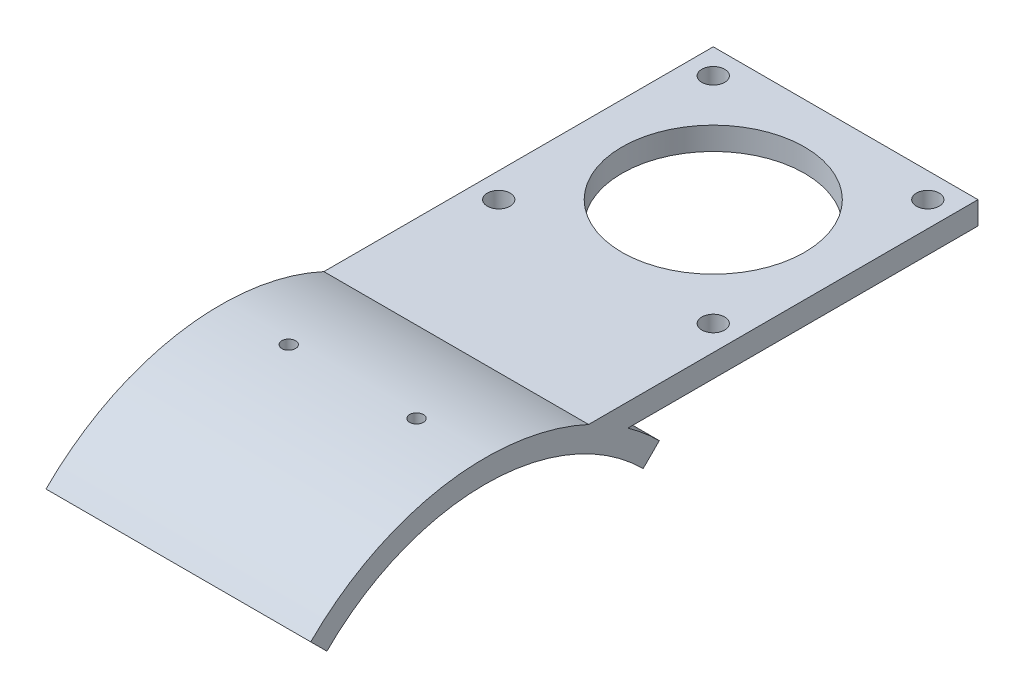
ISO-10303-21;
HEADER;
FILE_DESCRIPTION(('STEP AP214'),'2;1');
FILE_NAME('part.step','',(''),(''),'','','');
FILE_SCHEMA(('AUTOMOTIVE_DESIGN { 1 0 10303 214 1 1 1 1 }'));
ENDSEC;
DATA;
#1=APPLICATION_CONTEXT('core data for automotive mechanical design processes');
#2=APPLICATION_PROTOCOL_DEFINITION('international standard','automotive_design',2000,#1);
#3=PRODUCT_CONTEXT('',#1,'mechanical');
#4=PRODUCT('Part','Part','',(#3));
#5=PRODUCT_RELATED_PRODUCT_CATEGORY('part','',(#4));
#6=PRODUCT_DEFINITION_FORMATION('','',#4);
#7=PRODUCT_DEFINITION_CONTEXT('part definition',#1,'design');
#8=PRODUCT_DEFINITION('design','',#6,#7);
#9=PRODUCT_DEFINITION_SHAPE('','',#8);
#10=(LENGTH_UNIT() NAMED_UNIT(*) SI_UNIT(.MILLI.,.METRE.));
#11=(NAMED_UNIT(*) PLANE_ANGLE_UNIT() SI_UNIT($,.RADIAN.));
#12=(NAMED_UNIT(*) SI_UNIT($,.STERADIAN.) SOLID_ANGLE_UNIT());
#13=UNCERTAINTY_MEASURE_WITH_UNIT(LENGTH_MEASURE(1.E-05),#10,'distance_accuracy_value','');
#14=(GEOMETRIC_REPRESENTATION_CONTEXT(3) GLOBAL_UNCERTAINTY_ASSIGNED_CONTEXT((#13)) GLOBAL_UNIT_ASSIGNED_CONTEXT((#10,
#11,#12)) REPRESENTATION_CONTEXT('',''));
#15=CARTESIAN_POINT('',(0.,0.,0.));
#16=DIRECTION('',(0.,0.,1.));
#17=DIRECTION('',(1.,0.,0.));
#18=AXIS2_PLACEMENT_3D('',#15,#16,#17);
#19=CARTESIAN_POINT('',(58.,-49.,0.));
#20=DIRECTION('',(-1.,0.,0.));
#21=DIRECTION('',(0.,0.,1.));
#22=AXIS2_PLACEMENT_3D('',#19,#20,#21);
#23=CYLINDRICAL_SURFACE('',#22,54.);
#24=CARTESIAN_POINT('',(15.,4.97916264633973,-1.5));
#25=CARTESIAN_POINT('',(14.9157617818594,4.97916292759127,-1.4999962697119));
#26=CARTESIAN_POINT('',(14.8314628967319,4.97936195378429,-1.49288010498638));
#27=CARTESIAN_POINT('',(14.6651879580694,4.98013675004673,-1.46459173198199));
#28=CARTESIAN_POINT('',(14.5832148045829,4.98071297061975,-1.44340271529465));
#29=CARTESIAN_POINT('',(14.4240242210122,4.98217683116193,-1.38757338006493));
#30=CARTESIAN_POINT('',(14.3468044934685,4.98306431927556,-1.35293961982023));
#31=CARTESIAN_POINT('',(14.1992967478397,4.98505051841892,-1.27121327193724));
#32=CARTESIAN_POINT('',(14.129007038924,4.98614917773183,-1.22412373371793));
#33=CARTESIAN_POINT('',(13.9973039831279,4.98843445369547,-1.11879957157692));
#34=CARTESIAN_POINT('',(13.9358937131143,4.98962110062087,-1.06056110054096));
#35=CARTESIAN_POINT('',(13.8237185609425,4.99194833217108,-0.934598752068324));
#36=CARTESIAN_POINT('',(13.7729541018723,4.99308891496375,-0.866874497823953));
#37=CARTESIAN_POINT('',(13.6835075489127,4.99519557614055,-0.723852589454354));
#38=CARTESIAN_POINT('',(13.6448271840814,4.99616162954374,-0.648553853566808));
#39=CARTESIAN_POINT('',(13.5806581185904,4.99781010873021,-0.492528174295414));
#40=CARTESIAN_POINT('',(13.555169368811,4.99849253556959,-0.411801251124983));
#41=CARTESIAN_POINT('',(13.5181133603416,4.99949667712531,-0.247232903532651));
#42=CARTESIAN_POINT('',(13.506542488956,4.99981848544674,-0.163392293165112));
#43=CARTESIAN_POINT('',(13.4976395672055,5.00006542723468,0.00504189886415992));
#44=CARTESIAN_POINT('',(13.5003074644804,4.99999056215987,0.0896354777558623));
#45=CARTESIAN_POINT('',(13.5198032830859,4.99945267694046,0.257149821465281));
#46=CARTESIAN_POINT('',(13.53662729998,4.99898976382453,0.340071041084011));
#47=CARTESIAN_POINT('',(13.5839517483097,4.99772807990447,0.501911727654212));
#48=CARTESIAN_POINT('',(13.6144522075773,4.99692930841686,0.580831186461557));
#49=CARTESIAN_POINT('',(13.6882682198389,4.99508575332067,0.732440646581693));
#50=CARTESIAN_POINT('',(13.7315855625671,4.99404093535863,0.805129776069335));
#51=CARTESIAN_POINT('',(13.8298043792621,4.99182304238371,0.942205619379503));
#52=CARTESIAN_POINT('',(13.8847058752588,4.99064996712692,1.00659231741272));
#53=CARTESIAN_POINT('',(14.0045566502031,4.98830730090679,1.12525836084267));
#54=CARTESIAN_POINT('',(14.0695093180798,4.98713771125475,1.17953428356121));
#55=CARTESIAN_POINT('',(14.2076067019493,4.98493427597559,1.276411723899));
#56=CARTESIAN_POINT('',(14.2807514192431,4.98390043037003,1.31901323966435));
#57=CARTESIAN_POINT('',(14.4331584869265,4.98208508233468,1.39133217569352));
#58=CARTESIAN_POINT('',(14.5124208892622,4.98130358204788,1.42104948654181));
#59=CARTESIAN_POINT('',(14.6748124717556,4.98008113313439,1.46675424476639));
#60=CARTESIAN_POINT('',(14.7579416428515,4.97964018370967,1.48274172431697));
#61=CARTESIAN_POINT('',(14.9256772396059,4.97914869894478,1.50052879463532));
#62=CARTESIAN_POINT('',(15.0102831621887,4.97909803315392,1.50233312606613));
#63=CARTESIAN_POINT('',(15.1785967353642,4.97939248809537,1.49171503391734));
#64=CARTESIAN_POINT('',(15.2623043868432,4.97973760843708,1.47929262437793));
#65=CARTESIAN_POINT('',(15.4264320235609,4.98078461077078,1.44057760512654));
#66=CARTESIAN_POINT('',(15.5068525170401,4.98148643738383,1.41428714841584));
#67=CARTESIAN_POINT('',(15.6621385752962,4.98316768693185,1.34858451455344));
#68=CARTESIAN_POINT('',(15.7370041305899,4.98414711034071,1.30917231500142));
#69=CARTESIAN_POINT('',(15.8790769764869,4.98627346001791,1.21833275044408));
#70=CARTESIAN_POINT('',(15.9462822247022,4.98742043077255,1.16690219220532));
#71=CARTESIAN_POINT('',(16.0711062260081,4.98975241685706,1.05349052957631));
#72=CARTESIAN_POINT('',(16.1287249575708,4.99093743227236,0.991509401493973));
#73=CARTESIAN_POINT('',(16.2327561375288,4.99321229794382,0.858735727671517));
#74=CARTESIAN_POINT('',(16.2791655285893,4.99430212218508,0.787940785934883));
#75=CARTESIAN_POINT('',(16.35943971584,4.99626338072533,0.639561355594224));
#76=CARTESIAN_POINT('',(16.3933045381539,4.99713481547911,0.561976881129636));
#77=CARTESIAN_POINT('',(16.4475229331903,4.9985609354325,0.402232265380035));
#78=CARTESIAN_POINT('',(16.4678784891357,4.9991156671239,0.320072797645568));
#79=CARTESIAN_POINT('',(16.4945070387233,4.99984603166259,0.153500833727171));
#80=CARTESIAN_POINT('',(16.5007800393144,5.00002166469693,0.0690883386550062));
#81=CARTESIAN_POINT('',(16.4990651738358,4.99997403577854,-0.0995628843776949));
#82=CARTESIAN_POINT('',(16.4910821291345,4.99975090868573,-0.183801661443545));
#83=CARTESIAN_POINT('',(16.461091688717,4.99893116776891,-0.349742853279947));
#84=CARTESIAN_POINT('',(16.4390842651638,4.99833455320357,-0.431445263015735));
#85=CARTESIAN_POINT('',(16.3816703628346,4.99683504558709,-0.589996526137956));
#86=CARTESIAN_POINT('',(16.3462636546536,4.9959321472922,-0.666845296400451));
#87=CARTESIAN_POINT('',(16.2630581343751,4.99392182150439,-0.813505946148473));
#88=CARTESIAN_POINT('',(16.2152597759056,4.99281440149893,-0.883318083098023));
#89=CARTESIAN_POINT('',(16.1086144311051,4.99051945763676,-1.0139453858344));
#90=CARTESIAN_POINT('',(16.049764887359,4.98933191527935,-1.07475846326365));
#91=CARTESIAN_POINT('',(15.9226744260106,4.98701047901731,-1.18565812553995));
#92=CARTESIAN_POINT('',(15.8544311853236,4.98587659847689,-1.2357420491842));
#93=CARTESIAN_POINT('',(15.7104659219413,4.98378998875727,-1.32376904679058));
#94=CARTESIAN_POINT('',(15.6347392597637,4.98283737304061,-1.36170452652514));
#95=CARTESIAN_POINT('',(15.4780477325282,4.98122282709044,-1.42427916659829));
#96=CARTESIAN_POINT('',(15.3970892486569,4.98056055013531,-1.44893419450462));
#97=CARTESIAN_POINT('',(15.2630155921275,4.97977853060093,-1.47770893356339));
#98=CARTESIAN_POINT('',(15.2107708019174,4.97954857619368,-1.48605757762348));
#99=CARTESIAN_POINT('',(15.1056919699062,4.97924054584215,-1.49720428048581));
#100=CARTESIAN_POINT('',(15.0528579282537,4.97916246985958,-1.50000234068698));
#101=CARTESIAN_POINT('',(15.,4.97916264633973,-1.5));
#102=B_SPLINE_CURVE_WITH_KNOTS('',3,(#24,#25,#26,#27,#28,#29,#30,#31,#32,#33,#34,#35,#36,#37,
#38,#39,#40,#41,#42,#43,#44,#45,#46,#47,#48,#49,#50,#51,#52,#53,#54,#55,#56,#57,#58,#59,#60,#61,
#62,#63,#64,#65,#66,#67,#68,#69,#70,#71,#72,#73,#74,#75,#76,#77,#78,#79,#80,#81,#82,#83,#84,#85,
#86,#87,#88,#89,#90,#91,#92,#93,#94,#95,#96,#97,#98,#99,#100,#101),.UNSPECIFIED.,.T.,.F.,(4,2,2,
2,2,2,2,2,2,2,2,2,2,2,2,2,2,2,2,2,2,2,2,2,2,2,2,2,2,2,2,2,2,2,2,2,2,2,4),(0.,0.252521717052329,
0.505345586051272,0.758046283128763,1.01068517128276,1.26341139410214,1.51614765891835,
1.76892007007343,2.02169154000989,2.27439738330734,2.52710229733078,2.77973753498833,
3.0323732867723,3.28504433297249,3.53771585968755,3.79047276541315,4.04322971127656,
4.29598880356596,4.54874730354162,4.801421316361,5.05409507981991,5.30672962745492,
5.55936460636857,5.81206678593596,6.06476953297256,6.31754112675861,6.57031219415158,
6.82304614536903,7.07577997187629,7.32842834045143,7.58107721050897,7.83373040628491,
8.08637435435147,8.33907684034282,8.59184193294208,8.8447647268471,9.09738465288879,
9.25583741294422,9.41429013306435),.UNSPECIFIED.);
#103=CARTESIAN_POINT('',(15.,4.97916264633973,-1.5));
#104=VERTEX_POINT('',#103);
#105=EDGE_CURVE('E169',#104,#104,#102,.T.);
#106=ORIENTED_EDGE('',*,*,#105,.F.);
#107=EDGE_LOOP('',(#106));
#108=FACE_BOUND('',#107,.T.);
#109=CARTESIAN_POINT('',(0.,-49.,0.));
#110=DIRECTION('',(1.,0.,0.));
#111=DIRECTION('',(0.,0.,-1.));
#112=AXIS2_PLACEMENT_3D('',#109,#110,#111);
#113=CIRCLE('',#112,54.);
#114=CARTESIAN_POINT('',(0.,0.,-22.6936114358204));
#115=VERTEX_POINT('',#114);
#116=CARTESIAN_POINT('',(0.,-10.8162338159265,38.1837661840737));
#117=VERTEX_POINT('',#116);
#118=EDGE_CURVE('E85',#115,#117,#113,.T.);
#119=ORIENTED_EDGE('',*,*,#118,.T.);
#120=DIRECTION('',(-1.,0.,0.));
#121=VECTOR('',#120,1.);
#122=CARTESIAN_POINT('',(58.,-10.8162338159265,38.1837661840737));
#123=LINE('',#122,#121);
#124=CARTESIAN_POINT('',(58.,-10.8162338159265,38.1837661840737));
#125=VERTEX_POINT('',#124);
#126=EDGE_CURVE('E130',#125,#117,#123,.T.);
#127=ORIENTED_EDGE('',*,*,#126,.F.);
#128=CARTESIAN_POINT('',(58.,-49.,0.));
#129=DIRECTION('',(1.,0.,0.));
#130=DIRECTION('',(0.,0.,1.));
#131=AXIS2_PLACEMENT_3D('',#128,#129,#130);
#132=CIRCLE('',#131,54.);
#133=CARTESIAN_POINT('',(58.,0.,-22.6936114358204));
#134=VERTEX_POINT('',#133);
#135=EDGE_CURVE('E117',#134,#125,#132,.T.);
#136=ORIENTED_EDGE('',*,*,#135,.F.);
#137=DIRECTION('',(-1.,0.,0.));
#138=VECTOR('',#137,1.);
#139=CARTESIAN_POINT('',(58.,0.,-22.6936114358204));
#140=LINE('',#139,#138);
#141=EDGE_CURVE('E125',#134,#115,#140,.T.);
#142=ORIENTED_EDGE('',*,*,#141,.T.);
#143=EDGE_LOOP('',(#119,#127,#136,#142));
#144=FACE_BOUND('',#143,.T.);
#145=CARTESIAN_POINT('',(43.,4.97916264633973,-1.5));
#146=CARTESIAN_POINT('',(42.9157617818595,4.97916292759127,-1.49999626971189));
#147=CARTESIAN_POINT('',(42.8314628967319,4.97936195378429,-1.49288010498638));
#148=CARTESIAN_POINT('',(42.6651879580694,4.98013675004673,-1.46459173198199));
#149=CARTESIAN_POINT('',(42.5832148045829,4.98071297061975,-1.44340271529465));
#150=CARTESIAN_POINT('',(42.4240242210122,4.98217683116193,-1.38757338006493));
#151=CARTESIAN_POINT('',(42.3468044934685,4.98306431927556,-1.35293961982023));
#152=CARTESIAN_POINT('',(42.1992967478397,4.98505051841892,-1.27121327193724));
#153=CARTESIAN_POINT('',(42.129007038924,4.98614917773183,-1.22412373371793));
#154=CARTESIAN_POINT('',(41.9973039831279,4.98843445369547,-1.11879957157692));
#155=CARTESIAN_POINT('',(41.9358937131143,4.98962110062087,-1.06056110054097));
#156=CARTESIAN_POINT('',(41.8237185609425,4.99194833217108,-0.934598752068325));
#157=CARTESIAN_POINT('',(41.7729541018723,4.99308891496375,-0.866874497823953));
#158=CARTESIAN_POINT('',(41.6835075489127,4.99519557614055,-0.723852589454355));
#159=CARTESIAN_POINT('',(41.6448271840814,4.99616162954374,-0.64855385356681));
#160=CARTESIAN_POINT('',(41.5806581185904,4.99781010873021,-0.492528174295419));
#161=CARTESIAN_POINT('',(41.555169368811,4.99849253556959,-0.411801251124988));
#162=CARTESIAN_POINT('',(41.5181133603416,4.99949667712531,-0.247232903532657));
#163=CARTESIAN_POINT('',(41.506542488956,4.99981848544674,-0.16339229316512));
#164=CARTESIAN_POINT('',(41.4976395672055,5.00006542723468,0.00504189886415126));
#165=CARTESIAN_POINT('',(41.5003074644804,4.99999056215987,0.0896354777558533));
#166=CARTESIAN_POINT('',(41.5198032830859,4.99945267694046,0.257149821465272));
#167=CARTESIAN_POINT('',(41.5366272999801,4.99898976382453,0.340071041084001));
#168=CARTESIAN_POINT('',(41.5839517483097,4.99772807990447,0.501911727654204));
#169=CARTESIAN_POINT('',(41.6144522075774,4.99692930841686,0.58083118646155));
#170=CARTESIAN_POINT('',(41.6882682198389,4.99508575332067,0.732440646581686));
#171=CARTESIAN_POINT('',(41.7315855625671,4.99404093535863,0.80512977606933));
#172=CARTESIAN_POINT('',(41.8298043792621,4.99182304238371,0.942205619379497));
#173=CARTESIAN_POINT('',(41.8847058752588,4.99064996712692,1.00659231741271));
#174=CARTESIAN_POINT('',(42.0045566502031,4.98830730090679,1.12525836084266));
#175=CARTESIAN_POINT('',(42.0695093180798,4.98713771125475,1.17953428356121));
#176=CARTESIAN_POINT('',(42.2076067019493,4.98493427597559,1.27641172389899));
#177=CARTESIAN_POINT('',(42.2807514192431,4.98390043037003,1.31901323966434));
#178=CARTESIAN_POINT('',(42.4331584869265,4.98208508233468,1.39133217569351));
#179=CARTESIAN_POINT('',(42.5124208892622,4.98130358204788,1.42104948654181));
#180=CARTESIAN_POINT('',(42.6748124717556,4.98008113313439,1.46675424476639));
#181=CARTESIAN_POINT('',(42.7579416428515,4.97964018370967,1.48274172431697));
#182=CARTESIAN_POINT('',(42.925677239606,4.97914869894478,1.50052879463532));
#183=CARTESIAN_POINT('',(43.0102831621887,4.97909803315392,1.50233312606613));
#184=CARTESIAN_POINT('',(43.1785967353642,4.97939248809537,1.49171503391734));
#185=CARTESIAN_POINT('',(43.2623043868433,4.97973760843708,1.47929262437793));
#186=CARTESIAN_POINT('',(43.4264320235609,4.98078461077078,1.44057760512654));
#187=CARTESIAN_POINT('',(43.5068525170401,4.98148643738383,1.41428714841584));
#188=CARTESIAN_POINT('',(43.6621385752962,4.98316768693185,1.34858451455345));
#189=CARTESIAN_POINT('',(43.7370041305899,4.98414711034071,1.30917231500142));
#190=CARTESIAN_POINT('',(43.8790769764869,4.98627346001791,1.21833275044409));
#191=CARTESIAN_POINT('',(43.9462822247022,4.98742043077255,1.16690219220532));
#192=CARTESIAN_POINT('',(44.0711062260081,4.98975241685706,1.05349052957631));
#193=CARTESIAN_POINT('',(44.1287249575708,4.99093743227236,0.991509401493975));
#194=CARTESIAN_POINT('',(44.2327561375288,4.99321229794382,0.858735727671517));
#195=CARTESIAN_POINT('',(44.2791655285893,4.99430212218508,0.787940785934883));
#196=CARTESIAN_POINT('',(44.35943971584,4.99626338072533,0.639561355594224));
#197=CARTESIAN_POINT('',(44.3933045381539,4.99713481547912,0.561976881129636));
#198=CARTESIAN_POINT('',(44.4475229331904,4.99856093543251,0.402232265380035));
#199=CARTESIAN_POINT('',(44.4678784891357,4.99911566712391,0.320072797645569));
#200=CARTESIAN_POINT('',(44.4945070387233,4.99984603166259,0.153500833727175));
#201=CARTESIAN_POINT('',(44.5007800393144,5.00002166469694,0.0690883386550115));
#202=CARTESIAN_POINT('',(44.4990651738358,4.99997403577854,-0.0995628843776885));
#203=CARTESIAN_POINT('',(44.4910821291346,4.99975090868572,-0.183801661443539));
#204=CARTESIAN_POINT('',(44.4610916887171,4.99893116776891,-0.34974285327994));
#205=CARTESIAN_POINT('',(44.4390842651638,4.99833455320356,-0.431445263015727));
#206=CARTESIAN_POINT('',(44.3816703628346,4.99683504558709,-0.589996526137949));
#207=CARTESIAN_POINT('',(44.3462636546536,4.9959321472922,-0.666845296400446));
#208=CARTESIAN_POINT('',(44.2630581343751,4.99392182150439,-0.813505946148468));
#209=CARTESIAN_POINT('',(44.2152597759056,4.99281440149893,-0.883318083098016));
#210=CARTESIAN_POINT('',(44.1086144311051,4.99051945763676,-1.0139453858344));
#211=CARTESIAN_POINT('',(44.049764887359,4.98933191527935,-1.07475846326365));
#212=CARTESIAN_POINT('',(43.9226744260106,4.98701047901731,-1.18565812553995));
#213=CARTESIAN_POINT('',(43.8544311853236,4.98587659847689,-1.23574204918419));
#214=CARTESIAN_POINT('',(43.7104659219414,4.98378998875727,-1.32376904679057));
#215=CARTESIAN_POINT('',(43.6347392597637,4.98283737304061,-1.36170452652514));
#216=CARTESIAN_POINT('',(43.4780477325282,4.98122282709044,-1.42427916659828));
#217=CARTESIAN_POINT('',(43.3970892486569,4.98056055013531,-1.44893419450462));
#218=CARTESIAN_POINT('',(43.2630155921276,4.97977853060093,-1.47770893356338));
#219=CARTESIAN_POINT('',(43.2107708019174,4.97954857619368,-1.48605757762348));
#220=CARTESIAN_POINT('',(43.1056919699062,4.97924054584215,-1.49720428048581));
#221=CARTESIAN_POINT('',(43.0528579282537,4.97916246985958,-1.50000234068698));
#222=CARTESIAN_POINT('',(43.,4.97916264633973,-1.5));
#223=B_SPLINE_CURVE_WITH_KNOTS('',3,(#145,#146,#147,#148,#149,#150,#151,#152,#153,#154,#155,
#156,#157,#158,#159,#160,#161,#162,#163,#164,#165,#166,#167,#168,#169,#170,#171,#172,#173,#174,
#175,#176,#177,#178,#179,#180,#181,#182,#183,#184,#185,#186,#187,#188,#189,#190,#191,#192,#193,
#194,#195,#196,#197,#198,#199,#200,#201,#202,#203,#204,#205,#206,#207,#208,#209,#210,#211,#212,
#213,#214,#215,#216,#217,#218,#219,#220,#221,#222),.UNSPECIFIED.,.T.,.F.,(4,2,2,2,2,2,2,2,2,2,2,
2,2,2,2,2,2,2,2,2,2,2,2,2,2,2,2,2,2,2,2,2,2,2,2,2,2,2,4),(0.,0.252521717052327,
0.505345586051266,0.758046283128754,1.01068517128276,1.26341139410213,1.51614765891834,
1.76892007007342,2.02169154000988,2.27439738330733,2.52710229733077,2.77973753498832,
3.03237328677229,3.28504433297248,3.53771585968754,3.79047276541314,4.04322971127654,
4.29598880356595,4.54874730354161,4.80142131636098,5.05409507981989,5.3067296274549,
5.55936460636855,5.81206678593595,6.06476953297255,6.3175411267586,6.57031219415157,
6.82304614536902,7.07577997187628,7.32842834045142,7.58107721050895,7.83373040628489,
8.08637435435146,8.33907684034281,8.59184193294206,8.84476472684708,9.09738465288877,
9.25583741294422,9.41429013306433),.UNSPECIFIED.);
#224=CARTESIAN_POINT('',(43.,4.97916264633973,-1.5));
#225=VERTEX_POINT('',#224);
#226=EDGE_CURVE('E170',#225,#225,#223,.T.);
#227=ORIENTED_EDGE('',*,*,#226,.F.);
#228=EDGE_LOOP('',(#227));
#229=FACE_BOUND('',#228,.T.);
#230=ADVANCED_FACE('F33',(#108,#144,#229),#23,.T.);
#231=CARTESIAN_POINT('',(58.,-49.,0.));
#232=DIRECTION('',(-1.,0.,0.));
#233=DIRECTION('',(0.,0.,1.));
#234=AXIS2_PLACEMENT_3D('',#231,#232,#233);
#235=CYLINDRICAL_SURFACE('',#234,49.);
#236=CARTESIAN_POINT('',(15.,-0.0229645650127314,-1.5));
#237=CARTESIAN_POINT('',(15.0842344768163,-0.0229642551864852,-1.4999962710253));
#238=CARTESIAN_POINT('',(15.1685295291705,-0.022744921248589,-1.49288073588983));
#239=CARTESIAN_POINT('',(15.3347966511735,-0.0218910741984915,-1.46459500949605));
#240=CARTESIAN_POINT('',(15.4167658248491,-0.0212560653206218,-1.44340803512387));
#241=CARTESIAN_POINT('',(15.5759484284389,-0.0196428690405995,-1.38758444387315));
#242=CARTESIAN_POINT('',(15.6531641657536,-0.0186648497106478,-1.35295441309153));
#243=CARTESIAN_POINT('',(15.8006647220613,-0.0164760505076152,-1.27123718905885));
#244=CARTESIAN_POINT('',(15.870951225939,-0.0152653274300943,-1.22415303440934));
#245=CARTESIAN_POINT('',(16.0026527212954,-0.0127468814460927,-1.11883826939817));
#246=CARTESIAN_POINT('',(16.0640641761237,-0.0114391201829645,-1.06060323685686));
#247=CARTESIAN_POINT('',(16.1762425567017,-0.00887434090514233,-0.93464756013043));
#248=CARTESIAN_POINT('',(16.2270090583124,-0.00761732491395983,-0.86692653816364));
#249=CARTESIAN_POINT('',(16.3164621715613,-0.00529553655341679,-0.723907866482441));
#250=CARTESIAN_POINT('',(16.3551466346779,-0.00423079839056896,-0.648608872338735));
#251=CARTESIAN_POINT('',(16.4193235841844,-0.00241389117635997,-0.492581297898576));
#252=CARTESIAN_POINT('',(16.444816124545,-0.00166172084622339,-0.411852739817088));
#253=CARTESIAN_POINT('',(16.4818779110574,-0.000554947180819743,-0.247284592368737));
#254=CARTESIAN_POINT('',(16.4934515500801,-0.000200218413534945,-0.163445993161235));
#255=CARTESIAN_POINT('',(16.5023605343925,7.21063170832609E-05,0.00498478488456234));
#256=CARTESIAN_POINT('',(16.4996959377632,-1.02959364228532E-05,0.0895769606474351));
#257=CARTESIAN_POINT('',(16.4802077972737,-0.000602837263618457,0.257083868822811));
#258=CARTESIAN_POINT('',(16.463388996051,-0.00111283306368359,0.33999915358145));
#259=CARTESIAN_POINT('',(16.4160772073679,-0.00250291926370943,0.501828847478454));
#260=CARTESIAN_POINT('',(16.3855841892253,-0.00338301049409418,0.580743247639148));
#261=CARTESIAN_POINT('',(16.3117841148958,-0.00541434472592675,0.732346327421423));
#262=CARTESIAN_POINT('',(16.2684748857803,-0.00656563370092534,0.805033948624835));
#263=CARTESIAN_POINT('',(16.1702733981064,-0.00900961830244695,0.942108520620368));
#264=CARTESIAN_POINT('',(16.1153811117923,-0.0103023142678102,1.00649545152152));
#265=CARTESIAN_POINT('',(15.9955448561909,-0.0128840589929757,1.12516858365615));
#266=CARTESIAN_POINT('',(15.9305967714025,-0.0141731060384568,1.17945062917649));
#267=CARTESIAN_POINT('',(15.7925070769199,-0.0166016909453718,1.27634112255993));
#268=CARTESIAN_POINT('',(15.7193654658624,-0.0177412287819273,1.31894956848052));
#269=CARTESIAN_POINT('',(15.5669626113937,-0.0197422665749579,1.39128290820164));
#270=CARTESIAN_POINT('',(15.4877013037889,-0.0206037636143894,1.42100766683509));
#271=CARTESIAN_POINT('',(15.3253100678961,-0.0219514580500692,1.4667271737469));
#272=CARTESIAN_POINT('',(15.2421801505857,-0.0224376565111964,1.48272196098294));
#273=CARTESIAN_POINT('',(15.0744476168842,-0.0229797394037406,1.50052239005979));
#274=CARTESIAN_POINT('',(14.9898456120265,-0.0230357984387198,1.50233378927264));
#275=CARTESIAN_POINT('',(14.8215387046147,-0.0227117370203746,1.49173102699155));
#276=CARTESIAN_POINT('',(14.7378338009765,-0.0223316170941895,1.47931688268972));
#277=CARTESIAN_POINT('',(14.5737132525765,-0.021178207620779,1.44062019553115));
#278=CARTESIAN_POINT('',(14.4932969902584,-0.020404992260525,1.41434026945993));
#279=CARTESIAN_POINT('',(14.3380174977476,-0.0185526192721732,1.34866066685108));
#280=CARTESIAN_POINT('',(14.2631542792167,-0.0174734610015999,1.30926096276207));
#281=CARTESIAN_POINT('',(14.1210794582279,-0.0151304288147974,1.21844538599157));
#282=CARTESIAN_POINT('',(14.0538703351525,-0.0138664953456093,1.16702563604223));
#283=CARTESIAN_POINT('',(13.9290364360041,-0.0112966071139981,1.05363528047662));
#284=CARTESIAN_POINT('',(13.871411685247,-0.00999065224059163,0.991664646992373));
#285=CARTESIAN_POINT('',(13.7673630784262,-0.00748343313098747,0.858906990121548));
#286=CARTESIAN_POINT('',(13.7209429354695,-0.00628220368387268,0.788117055848146));
#287=CARTESIAN_POINT('',(13.6406466357446,-0.00412034029438637,0.6397451256224));
#288=CARTESIAN_POINT('',(13.6067704501047,-0.00315970579825273,0.562163145303432));
#289=CARTESIAN_POINT('',(13.5525301956364,-0.00158748661349168,0.402423387333204));
#290=CARTESIAN_POINT('',(13.5321637217435,-0.000975839799098344,0.32026642696646));
#291=CARTESIAN_POINT('',(13.5055131324281,-0.000170297410247326,0.153697263298042));
#292=CARTESIAN_POINT('',(13.4992290031198,2.35985761313055E-05,0.0692850622202201));
#293=CARTESIAN_POINT('',(13.5009217638512,-2.82137766004444E-05,-0.0993613031537324));
#294=CARTESIAN_POINT('',(13.5088928042379,-0.000273741796743473,-0.183595526283424));
#295=CARTESIAN_POINT('',(13.5388576040586,-0.00117638295243082,-0.349529551242143));
#296=CARTESIAN_POINT('',(13.5608513912263,-0.00183349690199633,-0.43122934805833));
#297=CARTESIAN_POINT('',(13.6182365381163,-0.00348529584798199,-0.589777551831928));
#298=CARTESIAN_POINT('',(13.6536281198098,-0.00447998643725497,-0.666625878386842));
#299=CARTESIAN_POINT('',(13.7368022565136,-0.00669486689550589,-0.81328843642984));
#300=CARTESIAN_POINT('',(13.7845843649839,-0.00791504863759313,-0.883102921283418));
#301=CARTESIAN_POINT('',(13.8912006180664,-0.0104439391319394,-1.01374302814597));
#302=CARTESIAN_POINT('',(13.9500381152545,-0.0117526746611303,-1.07456591340497));
#303=CARTESIAN_POINT('',(14.0771062733443,-0.0143112031798947,-1.18548734623917));
#304=CARTESIAN_POINT('',(14.1453392561941,-0.0155609814962844,-1.23558323496013));
#305=CARTESIAN_POINT('',(14.2892888313351,-0.017861099161498,-1.32363750246561));
#306=CARTESIAN_POINT('',(14.3650103004991,-0.0189113072224384,-1.3615879024562));
#307=CARTESIAN_POINT('',(14.5216947967685,-0.0206914623262511,-1.42419286567212));
#308=CARTESIAN_POINT('',(14.6026514450398,-0.0214217909938453,-1.4488632803722));
#309=CARTESIAN_POINT('',(14.7367660736521,-0.0222846503514629,-1.47767163600824));
#310=CARTESIAN_POINT('',(14.7890535829527,-0.0225385102444316,-1.48603423322171));
#311=CARTESIAN_POINT('',(14.8942194307186,-0.022878564840207,-1.49719958532674));
#312=CARTESIAN_POINT('',(14.9470977690022,-0.0229647595945732,-1.50000234192801));
#313=CARTESIAN_POINT('',(15.,-0.0229645650127314,-1.5));
#314=B_SPLINE_CURVE_WITH_KNOTS('',3,(#236,#237,#238,#239,#240,#241,#242,#243,#244,#245,#246,
#247,#248,#249,#250,#251,#252,#253,#254,#255,#256,#257,#258,#259,#260,#261,#262,#263,#264,#265,
#266,#267,#268,#269,#270,#271,#272,#273,#274,#275,#276,#277,#278,#279,#280,#281,#282,#283,#284,
#285,#286,#287,#288,#289,#290,#291,#292,#293,#294,#295,#296,#297,#298,#299,#300,#301,#302,#303,
#304,#305,#306,#307,#308,#309,#310,#311,#312,#313),.UNSPECIFIED.,.T.,.F.,(4,2,2,2,2,2,2,2,2,2,2,
2,2,2,2,2,2,2,2,2,2,2,2,2,2,2,2,2,2,2,2,2,2,2,2,2,2,2,4),(0.,0.252510330035444,
0.505322373236995,0.758010713359619,1.01063745845712,1.26336459774113,1.51610180480347,
1.76888392999347,2.02166502099275,2.27436631213127,2.52706657244245,2.7796821943861,
3.03229838315437,3.28495742637771,3.5376170750373,3.79038040349873,4.04314377402021,
4.29590979630292,4.54867510138018,4.80133779773114,5.05400018872982,5.30661491368732,
5.55923016913589,5.81192702259688,6.06462454351459,6.31740569151195,6.57018625769366,
6.82292181056768,7.07565711423306,7.32828873098188,7.58092084737883,7.83355714950152,
8.08618434817462,8.3388882807234,8.59165477758318,8.84458698630717,9.09721661266442,
9.25580208053529,9.41438749963883),.UNSPECIFIED.);
#315=CARTESIAN_POINT('',(15.,-0.0229645650127314,-1.5));
#316=VERTEX_POINT('',#315);
#317=EDGE_CURVE('E164',#316,#316,#314,.T.);
#318=ORIENTED_EDGE('',*,*,#317,.F.);
#319=EDGE_LOOP('',(#318));
#320=FACE_BOUND('',#319,.T.);
#321=CARTESIAN_POINT('',(0.,-49.,0.));
#322=DIRECTION('',(-1.,0.,0.));
#323=DIRECTION('',(0.,0.,-1.));
#324=AXIS2_PLACEMENT_3D('',#321,#322,#323);
#325=CIRCLE('',#324,49.);
#326=CARTESIAN_POINT('',(0.,-14.3517677218593,34.6482322781409));
#327=VERTEX_POINT('',#326);
#328=CARTESIAN_POINT('',(0.,-14.3517677218592,-34.6482322781409));
#329=VERTEX_POINT('',#328);
#330=EDGE_CURVE('E152',#327,#329,#325,.T.);
#331=ORIENTED_EDGE('',*,*,#330,.T.);
#332=DIRECTION('',(-1.,0.,0.));
#333=VECTOR('',#332,1.);
#334=CARTESIAN_POINT('',(58.,-14.3517677218592,-34.6482322781409));
#335=LINE('',#334,#333);
#336=CARTESIAN_POINT('',(58.,-14.3517677218592,-34.6482322781409));
#337=VERTEX_POINT('',#336);
#338=EDGE_CURVE('E11',#337,#329,#335,.T.);
#339=ORIENTED_EDGE('',*,*,#338,.F.);
#340=CARTESIAN_POINT('',(58.,-49.,0.));
#341=DIRECTION('',(-1.,0.,0.));
#342=DIRECTION('',(0.,0.,1.));
#343=AXIS2_PLACEMENT_3D('',#340,#341,#342);
#344=CIRCLE('',#343,49.);
#345=CARTESIAN_POINT('',(58.,-14.3517677218593,34.6482322781409));
#346=VERTEX_POINT('',#345);
#347=EDGE_CURVE('E56',#346,#337,#344,.T.);
#348=ORIENTED_EDGE('',*,*,#347,.F.);
#349=DIRECTION('',(-1.,0.,0.));
#350=VECTOR('',#349,1.);
#351=CARTESIAN_POINT('',(58.,-14.3517677218593,34.6482322781409));
#352=LINE('',#351,#350);
#353=EDGE_CURVE('E136',#346,#327,#352,.T.);
#354=ORIENTED_EDGE('',*,*,#353,.T.);
#355=EDGE_LOOP('',(#331,#339,#348,#354));
#356=FACE_BOUND('',#355,.T.);
#357=CARTESIAN_POINT('',(43.,-0.0229645650127314,-1.5));
#358=CARTESIAN_POINT('',(43.0842344768163,-0.0229642551864852,-1.4999962710253));
#359=CARTESIAN_POINT('',(43.1685295291705,-0.0227449212485891,-1.49288073588983));
#360=CARTESIAN_POINT('',(43.3347966511735,-0.0218910741984917,-1.46459500949605));
#361=CARTESIAN_POINT('',(43.4167658248491,-0.021256065320622,-1.44340803512387));
#362=CARTESIAN_POINT('',(43.5759484284389,-0.0196428690405996,-1.38758444387315));
#363=CARTESIAN_POINT('',(43.6531641657536,-0.0186648497106478,-1.35295441309153));
#364=CARTESIAN_POINT('',(43.8006647220613,-0.0164760505076152,-1.27123718905885));
#365=CARTESIAN_POINT('',(43.870951225939,-0.0152653274300944,-1.22415303440935));
#366=CARTESIAN_POINT('',(44.0026527212954,-0.0127468814460933,-1.11883826939817));
#367=CARTESIAN_POINT('',(44.0640641761238,-0.0114391201829656,-1.06060323685687));
#368=CARTESIAN_POINT('',(44.1762425567017,-0.00887434090514375,-0.934647560130432));
#369=CARTESIAN_POINT('',(44.2270090583125,-0.00761732491396114,-0.866926538163643));
#370=CARTESIAN_POINT('',(44.3164621715613,-0.00529553655341627,-0.723907866482445));
#371=CARTESIAN_POINT('',(44.355146634678,-0.00423079839056673,-0.648608872338741));
#372=CARTESIAN_POINT('',(44.4193235841844,-0.00241389117635476,-0.492581297898584));
#373=CARTESIAN_POINT('',(44.444816124545,-0.0016617208462169,-0.411852739817096));
#374=CARTESIAN_POINT('',(44.4818779110574,-0.000554947180813234,-0.247284592368745));
#375=CARTESIAN_POINT('',(44.4934515500801,-0.00020021841352969,-0.163445993161242));
#376=CARTESIAN_POINT('',(44.5023605343925,7.21063170855373E-05,0.00498478488455571));
#377=CARTESIAN_POINT('',(44.4996959377632,-1.02959364223016E-05,0.0895769606474288));
#378=CARTESIAN_POINT('',(44.4802077972738,-0.000602837263619716,0.257083868822805));
#379=CARTESIAN_POINT('',(44.463388996051,-0.00111283306368494,0.339999153581443));
#380=CARTESIAN_POINT('',(44.4160772073679,-0.00250291926371047,0.501828847478448));
#381=CARTESIAN_POINT('',(44.3855841892253,-0.00338301049409483,0.580743247639141));
#382=CARTESIAN_POINT('',(44.3117841148958,-0.00541434472592662,0.732346327421417));
#383=CARTESIAN_POINT('',(44.2684748857803,-0.00656563370092481,0.80503394862483));
#384=CARTESIAN_POINT('',(44.1702733981064,-0.00900961830244747,0.942108520620363));
#385=CARTESIAN_POINT('',(44.1153811117923,-0.0103023142678122,1.00649545152152));
#386=CARTESIAN_POINT('',(43.995544856191,-0.0128840589929741,1.12516858365614));
#387=CARTESIAN_POINT('',(43.9305967714025,-0.01417310603845,1.17945062917649));
#388=CARTESIAN_POINT('',(43.7925070769199,-0.0166016909453651,1.27634112255993));
#389=CARTESIAN_POINT('',(43.7193654658625,-0.0177412287819256,1.31894956848051));
#390=CARTESIAN_POINT('',(43.5669626113937,-0.0197422665749598,1.39128290820164));
#391=CARTESIAN_POINT('',(43.4877013037889,-0.02060376361439,1.42100766683509));
#392=CARTESIAN_POINT('',(43.3253100678961,-0.0219514580500688,1.46672717374689));
#393=CARTESIAN_POINT('',(43.2421801505857,-0.0224376565111963,1.48272196098294));
#394=CARTESIAN_POINT('',(43.0744476168842,-0.0229797394037408,1.50052239005979));
#395=CARTESIAN_POINT('',(42.9898456120265,-0.0230357984387198,1.50233378927264));
#396=CARTESIAN_POINT('',(42.8215387046147,-0.0227117370203746,1.49173102699155));
#397=CARTESIAN_POINT('',(42.7378338009765,-0.0223316170941894,1.47931688268972));
#398=CARTESIAN_POINT('',(42.5737132525765,-0.0211782076207789,1.44062019553115));
#399=CARTESIAN_POINT('',(42.4932969902584,-0.020404992260525,1.41434026945993));
#400=CARTESIAN_POINT('',(42.3380174977477,-0.0185526192721732,1.34866066685108));
#401=CARTESIAN_POINT('',(42.2631542792167,-0.0174734610015999,1.30926096276208));
#402=CARTESIAN_POINT('',(42.1210794582279,-0.0151304288147974,1.21844538599157));
#403=CARTESIAN_POINT('',(42.0538703351525,-0.0138664953456093,1.16702563604223));
#404=CARTESIAN_POINT('',(41.9290364360041,-0.0112966071139981,1.05363528047662));
#405=CARTESIAN_POINT('',(41.871411685247,-0.00999065224059158,0.991664646992378));
#406=CARTESIAN_POINT('',(41.7673630784262,-0.00748343313098741,0.858906990121554));
#407=CARTESIAN_POINT('',(41.7209429354695,-0.00628220368387261,0.788117055848152));
#408=CARTESIAN_POINT('',(41.6406466357446,-0.00412034029438627,0.639745125622406));
#409=CARTESIAN_POINT('',(41.6067704501048,-0.00315970579825262,0.562163145303438));
#410=CARTESIAN_POINT('',(41.5525301956364,-0.00158748661349155,0.402423387333211));
#411=CARTESIAN_POINT('',(41.5321637217435,-0.000975839799098187,0.320266426966467));
#412=CARTESIAN_POINT('',(41.5055131324281,-0.000170297410247135,0.15369726329805));
#413=CARTESIAN_POINT('',(41.4992290031198,2.35985761315113E-05,0.0692850622202271));
#414=CARTESIAN_POINT('',(41.5009217638512,-2.82137766002109E-05,-0.0993613031537257));
#415=CARTESIAN_POINT('',(41.5088928042379,-0.000273741796743227,-0.183595526283417));
#416=CARTESIAN_POINT('',(41.5388576040586,-0.00117638295243057,-0.349529551242136));
#417=CARTESIAN_POINT('',(41.5608513912263,-0.00183349690199607,-0.431229348058324));
#418=CARTESIAN_POINT('',(41.6182365381163,-0.00348529584798171,-0.589777551831923));
#419=CARTESIAN_POINT('',(41.6536281198098,-0.00447998643725467,-0.666625878386836));
#420=CARTESIAN_POINT('',(41.7368022565136,-0.00669486689550558,-0.813288436429834));
#421=CARTESIAN_POINT('',(41.7845843649839,-0.00791504863759282,-0.883102921283412));
#422=CARTESIAN_POINT('',(41.8912006180664,-0.0104439391319391,-1.01374302814596));
#423=CARTESIAN_POINT('',(41.9500381152545,-0.0117526746611301,-1.07456591340496));
#424=CARTESIAN_POINT('',(42.0771062733443,-0.0143112031798944,-1.18548734623917));
#425=CARTESIAN_POINT('',(42.1453392561941,-0.0155609814962841,-1.23558323496013));
#426=CARTESIAN_POINT('',(42.2892888313351,-0.0178610991614978,-1.32363750246561));
#427=CARTESIAN_POINT('',(42.3650103004991,-0.0189113072224382,-1.36158790245619));
#428=CARTESIAN_POINT('',(42.5216947967685,-0.0206914623262509,-1.42419286567212));
#429=CARTESIAN_POINT('',(42.6026514450399,-0.0214217909938451,-1.44886328037219));
#430=CARTESIAN_POINT('',(42.7367660736521,-0.0222846503514628,-1.47767163600824));
#431=CARTESIAN_POINT('',(42.7890535829528,-0.0225385102444315,-1.48603423322171));
#432=CARTESIAN_POINT('',(42.8942194307186,-0.022878564840207,-1.49719958532673));
#433=CARTESIAN_POINT('',(42.9470977690022,-0.0229647595945732,-1.50000234192801));
#434=CARTESIAN_POINT('',(43.,-0.0229645650127314,-1.5));
#435=B_SPLINE_CURVE_WITH_KNOTS('',3,(#357,#358,#359,#360,#361,#362,#363,#364,#365,#366,#367,
#368,#369,#370,#371,#372,#373,#374,#375,#376,#377,#378,#379,#380,#381,#382,#383,#384,#385,#386,
#387,#388,#389,#390,#391,#392,#393,#394,#395,#396,#397,#398,#399,#400,#401,#402,#403,#404,#405,
#406,#407,#408,#409,#410,#411,#412,#413,#414,#415,#416,#417,#418,#419,#420,#421,#422,#423,#424,
#425,#426,#427,#428,#429,#430,#431,#432,#433,#434),.UNSPECIFIED.,.T.,.F.,(4,2,2,2,2,2,2,2,2,2,2,
2,2,2,2,2,2,2,2,2,2,2,2,2,2,2,2,2,2,2,2,2,2,2,2,2,2,2,4),(0.,0.252510330035439,
0.505322373236991,0.758010713359613,1.01063745845711,1.26336459774112,1.51610180480347,
1.76888392999346,2.02166502099274,2.27436631213126,2.52706657244244,2.77968219438609,
3.03229838315436,3.2849574263777,3.53761707503729,3.79038040349871,4.0431437740202,
4.29590979630291,4.54867510138017,4.80133779773113,5.05400018872981,5.3066149136873,
5.55923016913588,5.81192702259687,6.06462454351458,6.31740569151194,6.57018625769365,
6.82292181056767,7.07565711423304,7.32828873098187,7.58092084737882,7.83355714950151,
8.0861843481746,8.33888828072339,8.59165477758316,8.84458698630716,9.09721661266441,
9.25580208053529,9.41438749963882),.UNSPECIFIED.);
#436=CARTESIAN_POINT('',(43.,-0.0229645650127314,-1.5));
#437=VERTEX_POINT('',#436);
#438=EDGE_CURVE('E37',#437,#437,#435,.T.);
#439=ORIENTED_EDGE('',*,*,#438,.F.);
#440=EDGE_LOOP('',(#439));
#441=FACE_BOUND('',#440,.T.);
#442=ADVANCED_FACE('F171',(#320,#356,#441),#235,.F.);
#443=CARTESIAN_POINT('',(58.,-14.3517677218592,-34.6482322781409));
#444=DIRECTION('',(0.,0.707106781186549,0.707106781186546));
#445=DIRECTION('',(0.,-0.707106781186546,0.707106781186549));
#446=AXIS2_PLACEMENT_3D('',#443,#444,#445);
#447=PLANE('',#446);
#448=DIRECTION('',(0.,0.707106781186546,-0.707106781186549));
#449=VECTOR('',#448,1.);
#450=CARTESIAN_POINT('',(0.,-14.3517677218592,-34.6482322781409));
#451=LINE('',#450,#449);
#452=CARTESIAN_POINT('',(0.,-10.8162338159265,-38.1837661840736));
#453=VERTEX_POINT('',#452);
#454=EDGE_CURVE('E140',#329,#453,#451,.T.);
#455=ORIENTED_EDGE('',*,*,#454,.T.);
#456=DIRECTION('',(-1.,0.,0.));
#457=VECTOR('',#456,1.);
#458=CARTESIAN_POINT('',(58.,-10.8162338159265,-38.1837661840736));
#459=LINE('',#458,#457);
#460=CARTESIAN_POINT('',(58.,-10.8162338159265,-38.1837661840736));
#461=VERTEX_POINT('',#460);
#462=EDGE_CURVE('E47',#461,#453,#459,.T.);
#463=ORIENTED_EDGE('',*,*,#462,.F.);
#464=DIRECTION('',(0.,0.707106781186546,-0.707106781186549));
#465=VECTOR('',#464,1.);
#466=CARTESIAN_POINT('',(58.,-14.3517677218592,-34.6482322781409));
#467=LINE('',#466,#465);
#468=EDGE_CURVE('E99',#337,#461,#467,.T.);
#469=ORIENTED_EDGE('',*,*,#468,.F.);
#470=ORIENTED_EDGE('',*,*,#338,.T.);
#471=EDGE_LOOP('',(#455,#463,#469,#470));
#472=FACE_BOUND('',#471,.T.);
#473=ADVANCED_FACE('F35',(#472),#447,.F.);
#474=CARTESIAN_POINT('',(58.,-49.,0.));
#475=DIRECTION('',(-1.,0.,0.));
#476=DIRECTION('',(0.,0.,1.));
#477=AXIS2_PLACEMENT_3D('',#474,#475,#476);
#478=CYLINDRICAL_SURFACE('',#477,54.);
#479=CARTESIAN_POINT('',(0.,-49.,0.));
#480=DIRECTION('',(1.,0.,0.));
#481=DIRECTION('',(0.,0.,1.));
#482=AXIS2_PLACEMENT_3D('',#479,#480,#481);
#483=CIRCLE('',#482,54.);
#484=CARTESIAN_POINT('',(0.,-5.,-31.3049516849971));
#485=VERTEX_POINT('',#484);
#486=EDGE_CURVE('E142',#453,#485,#483,.T.);
#487=ORIENTED_EDGE('',*,*,#486,.T.);
#488=DIRECTION('',(-1.,0.,0.));
#489=VECTOR('',#488,1.);
#490=CARTESIAN_POINT('',(58.,-5.,-31.3049516849971));
#491=LINE('',#490,#489);
#492=CARTESIAN_POINT('',(58.,-5.,-31.3049516849971));
#493=VERTEX_POINT('',#492);
#494=EDGE_CURVE('E160',#493,#485,#491,.T.);
#495=ORIENTED_EDGE('',*,*,#494,.F.);
#496=CARTESIAN_POINT('',(58.,-49.,0.));
#497=DIRECTION('',(1.,0.,0.));
#498=DIRECTION('',(0.,0.,1.));
#499=AXIS2_PLACEMENT_3D('',#496,#497,#498);
#500=CIRCLE('',#499,54.);
#501=EDGE_CURVE('E230',#461,#493,#500,.T.);
#502=ORIENTED_EDGE('',*,*,#501,.F.);
#503=ORIENTED_EDGE('',*,*,#462,.T.);
#504=EDGE_LOOP('',(#487,#495,#502,#503));
#505=FACE_BOUND('',#504,.T.);
#506=ADVANCED_FACE('F211',(#505),#478,.T.);
#507=CARTESIAN_POINT('',(58.,-5.,-31.3049516849971));
#508=DIRECTION('',(0.,1.,0.));
#509=DIRECTION('',(0.,0.,1.));
#510=AXIS2_PLACEMENT_3D('',#507,#508,#509);
#511=PLANE('',#510);
#512=CARTESIAN_POINT('',(29.,-5.,-79.));
#513=DIRECTION('',(0.,1.,0.));
#514=DIRECTION('',(0.,0.,1.));
#515=AXIS2_PLACEMENT_3D('',#512,#513,#514);
#516=CIRCLE('',#515,20.);
#517=CARTESIAN_POINT('',(29.,-5.,-59.));
#518=VERTEX_POINT('',#517);
#519=EDGE_CURVE('E258',#518,#518,#516,.T.);
#520=ORIENTED_EDGE('',*,*,#519,.T.);
#521=EDGE_LOOP('',(#520));
#522=FACE_BOUND('',#521,.T.);
#523=CARTESIAN_POINT('',(5.50000000000003,-5.,-55.5));
#524=DIRECTION('',(0.,1.,0.));
#525=DIRECTION('',(0.,0.,1.));
#526=AXIS2_PLACEMENT_3D('',#523,#524,#525);
#527=CIRCLE('',#526,2.5);
#528=CARTESIAN_POINT('',(5.50000000000003,-5.,-53.));
#529=VERTEX_POINT('',#528);
#530=EDGE_CURVE('E253',#529,#529,#527,.T.);
#531=ORIENTED_EDGE('',*,*,#530,.T.);
#532=EDGE_LOOP('',(#531));
#533=FACE_BOUND('',#532,.T.);
#534=CARTESIAN_POINT('',(52.5,-5.,-55.5));
#535=DIRECTION('',(0.,1.,0.));
#536=DIRECTION('',(0.,0.,1.));
#537=AXIS2_PLACEMENT_3D('',#534,#535,#536);
#538=CIRCLE('',#537,2.5);
#539=CARTESIAN_POINT('',(52.5,-5.,-53.));
#540=VERTEX_POINT('',#539);
#541=EDGE_CURVE('E247',#540,#540,#538,.T.);
#542=ORIENTED_EDGE('',*,*,#541,.T.);
#543=EDGE_LOOP('',(#542));
#544=FACE_BOUND('',#543,.T.);
#545=CARTESIAN_POINT('',(52.5,-5.,-102.5));
#546=DIRECTION('',(0.,1.,0.));
#547=DIRECTION('',(0.,0.,1.));
#548=AXIS2_PLACEMENT_3D('',#545,#546,#547);
#549=CIRCLE('',#548,2.5);
#550=CARTESIAN_POINT('',(52.5,-5.,-100.));
#551=VERTEX_POINT('',#550);
#552=EDGE_CURVE('E241',#551,#551,#549,.T.);
#553=ORIENTED_EDGE('',*,*,#552,.T.);
#554=EDGE_LOOP('',(#553));
#555=FACE_BOUND('',#554,.T.);
#556=CARTESIAN_POINT('',(5.50000000000001,-5.,-102.5));
#557=DIRECTION('',(0.,1.,0.));
#558=DIRECTION('',(0.,0.,1.));
#559=AXIS2_PLACEMENT_3D('',#556,#557,#558);
#560=CIRCLE('',#559,2.5);
#561=CARTESIAN_POINT('',(5.50000000000001,-5.,-100.));
#562=VERTEX_POINT('',#561);
#563=EDGE_CURVE('E143',#562,#562,#560,.T.);
#564=ORIENTED_EDGE('',*,*,#563,.T.);
#565=EDGE_LOOP('',(#564));
#566=FACE_BOUND('',#565,.T.);
#567=DIRECTION('',(0.,0.,-1.));
#568=VECTOR('',#567,1.);
#569=CARTESIAN_POINT('',(0.,-5.,-31.3049516849971));
#570=LINE('',#569,#568);
#571=CARTESIAN_POINT('',(0.,-5.,-108.));
#572=VERTEX_POINT('',#571);
#573=EDGE_CURVE('E145',#485,#572,#570,.T.);
#574=ORIENTED_EDGE('',*,*,#573,.T.);
#575=DIRECTION('',(-1.,0.,0.));
#576=VECTOR('',#575,1.);
#577=CARTESIAN_POINT('',(58.,-5.,-108.));
#578=LINE('',#577,#576);
#579=CARTESIAN_POINT('',(58.,-5.,-108.));
#580=VERTEX_POINT('',#579);
#581=EDGE_CURVE('E157',#580,#572,#578,.T.);
#582=ORIENTED_EDGE('',*,*,#581,.F.);
#583=DIRECTION('',(0.,0.,-1.));
#584=VECTOR('',#583,1.);
#585=CARTESIAN_POINT('',(58.,-5.,-31.3049516849971));
#586=LINE('',#585,#584);
#587=EDGE_CURVE('E227',#493,#580,#586,.T.);
#588=ORIENTED_EDGE('',*,*,#587,.F.);
#589=ORIENTED_EDGE('',*,*,#494,.T.);
#590=EDGE_LOOP('',(#574,#582,#588,#589));
#591=FACE_BOUND('',#590,.T.);
#592=ADVANCED_FACE('F208',(#522,#533,#544,#555,#566,#591),#511,.F.);
#593=CARTESIAN_POINT('',(58.,0.,-108.));
#594=DIRECTION('',(0.,0.,1.));
#595=DIRECTION('',(1.,0.,0.));
#596=AXIS2_PLACEMENT_3D('',#593,#594,#595);
#597=PLANE('',#596);
#598=DIRECTION('',(0.,1.,0.));
#599=VECTOR('',#598,1.);
#600=CARTESIAN_POINT('',(0.,0.,-108.));
#601=LINE('',#600,#599);
#602=CARTESIAN_POINT('',(0.,0.,-108.));
#603=VERTEX_POINT('',#602);
#604=EDGE_CURVE('E147',#572,#603,#601,.T.);
#605=ORIENTED_EDGE('',*,*,#604,.T.);
#606=DIRECTION('',(-1.,0.,0.));
#607=VECTOR('',#606,1.);
#608=CARTESIAN_POINT('',(58.,0.,-108.));
#609=LINE('',#608,#607);
#610=CARTESIAN_POINT('',(58.,0.,-108.));
#611=VERTEX_POINT('',#610);
#612=EDGE_CURVE('E129',#611,#603,#609,.T.);
#613=ORIENTED_EDGE('',*,*,#612,.F.);
#614=DIRECTION('',(0.,1.,0.));
#615=VECTOR('',#614,1.);
#616=CARTESIAN_POINT('',(58.,0.,-108.));
#617=LINE('',#616,#615);
#618=EDGE_CURVE('E119',#580,#611,#617,.T.);
#619=ORIENTED_EDGE('',*,*,#618,.F.);
#620=ORIENTED_EDGE('',*,*,#581,.T.);
#621=EDGE_LOOP('',(#605,#613,#619,#620));
#622=FACE_BOUND('',#621,.T.);
#623=ADVANCED_FACE('F204',(#622),#597,.F.);
#624=CARTESIAN_POINT('',(58.,0.,-22.6936114358204));
#625=DIRECTION('',(0.,-1.,0.));
#626=DIRECTION('',(0.,0.,-1.));
#627=AXIS2_PLACEMENT_3D('',#624,#625,#626);
#628=PLANE('',#627);
#629=CARTESIAN_POINT('',(29.,0.,-79.));
#630=DIRECTION('',(0.,1.,0.));
#631=DIRECTION('',(0.,0.,1.));
#632=AXIS2_PLACEMENT_3D('',#629,#630,#631);
#633=CIRCLE('',#632,20.);
#634=CARTESIAN_POINT('',(29.,0.,-59.));
#635=VERTEX_POINT('',#634);
#636=EDGE_CURVE('E192',#635,#635,#633,.T.);
#637=ORIENTED_EDGE('',*,*,#636,.F.);
#638=EDGE_LOOP('',(#637));
#639=FACE_BOUND('',#638,.T.);
#640=CARTESIAN_POINT('',(5.50000000000003,0.,-55.5));
#641=DIRECTION('',(0.,1.,0.));
#642=DIRECTION('',(0.,0.,-1.));
#643=AXIS2_PLACEMENT_3D('',#640,#641,#642);
#644=CIRCLE('',#643,2.5);
#645=CARTESIAN_POINT('',(5.50000000000003,0.,-58.));
#646=VERTEX_POINT('',#645);
#647=EDGE_CURVE('E256',#646,#646,#644,.T.);
#648=ORIENTED_EDGE('',*,*,#647,.F.);
#649=EDGE_LOOP('',(#648));
#650=FACE_BOUND('',#649,.T.);
#651=CARTESIAN_POINT('',(52.5,0.,-55.5));
#652=DIRECTION('',(0.,1.,0.));
#653=DIRECTION('',(0.,0.,1.));
#654=AXIS2_PLACEMENT_3D('',#651,#652,#653);
#655=CIRCLE('',#654,2.5);
#656=CARTESIAN_POINT('',(52.5,0.,-53.));
#657=VERTEX_POINT('',#656);
#658=EDGE_CURVE('E250',#657,#657,#655,.T.);
#659=ORIENTED_EDGE('',*,*,#658,.F.);
#660=EDGE_LOOP('',(#659));
#661=FACE_BOUND('',#660,.T.);
#662=CARTESIAN_POINT('',(52.5,0.,-102.5));
#663=DIRECTION('',(0.,1.,0.));
#664=DIRECTION('',(0.,0.,-1.));
#665=AXIS2_PLACEMENT_3D('',#662,#663,#664);
#666=CIRCLE('',#665,2.5);
#667=CARTESIAN_POINT('',(52.5,0.,-105.));
#668=VERTEX_POINT('',#667);
#669=EDGE_CURVE('E244',#668,#668,#666,.T.);
#670=ORIENTED_EDGE('',*,*,#669,.F.);
#671=EDGE_LOOP('',(#670));
#672=FACE_BOUND('',#671,.T.);
#673=CARTESIAN_POINT('',(5.50000000000001,0.,-102.5));
#674=DIRECTION('',(0.,1.,0.));
#675=DIRECTION('',(0.,0.,1.));
#676=AXIS2_PLACEMENT_3D('',#673,#674,#675);
#677=CIRCLE('',#676,2.5);
#678=CARTESIAN_POINT('',(5.50000000000001,0.,-100.));
#679=VERTEX_POINT('',#678);
#680=EDGE_CURVE('E238',#679,#679,#677,.T.);
#681=ORIENTED_EDGE('',*,*,#680,.F.);
#682=EDGE_LOOP('',(#681));
#683=FACE_BOUND('',#682,.T.);
#684=DIRECTION('',(0.,0.,1.));
#685=VECTOR('',#684,1.);
#686=CARTESIAN_POINT('',(0.,0.,-22.6936114358204));
#687=LINE('',#686,#685);
#688=EDGE_CURVE('E128',#603,#115,#687,.T.);
#689=ORIENTED_EDGE('',*,*,#688,.T.);
#690=ORIENTED_EDGE('',*,*,#141,.F.);
#691=DIRECTION('',(0.,0.,1.));
#692=VECTOR('',#691,1.);
#693=CARTESIAN_POINT('',(58.,0.,-22.6936114358204));
#694=LINE('',#693,#692);
#695=EDGE_CURVE('E113',#611,#134,#694,.T.);
#696=ORIENTED_EDGE('',*,*,#695,.F.);
#697=ORIENTED_EDGE('',*,*,#612,.T.);
#698=EDGE_LOOP('',(#689,#690,#696,#697));
#699=FACE_BOUND('',#698,.T.);
#700=ADVANCED_FACE('F126',(#639,#650,#661,#672,#683,#699),#628,.F.);
#701=CARTESIAN_POINT('',(58.,-10.8162338159265,38.1837661840737));
#702=DIRECTION('',(0.,0.707106781186551,-0.707106781186544));
#703=DIRECTION('',(0.,0.707106781186544,0.707106781186551));
#704=AXIS2_PLACEMENT_3D('',#701,#702,#703);
#705=PLANE('',#704);
#706=DIRECTION('',(0.,-0.707106781186544,-0.707106781186551));
#707=VECTOR('',#706,1.);
#708=CARTESIAN_POINT('',(0.,-10.8162338159265,38.1837661840737));
#709=LINE('',#708,#707);
#710=EDGE_CURVE('E92',#117,#327,#709,.T.);
#711=ORIENTED_EDGE('',*,*,#710,.T.);
#712=ORIENTED_EDGE('',*,*,#353,.F.);
#713=DIRECTION('',(0.,-0.707106781186544,-0.707106781186551));
#714=VECTOR('',#713,1.);
#715=CARTESIAN_POINT('',(58.,-10.8162338159265,38.1837661840737));
#716=LINE('',#715,#714);
#717=EDGE_CURVE('E134',#125,#346,#716,.T.);
#718=ORIENTED_EDGE('',*,*,#717,.F.);
#719=ORIENTED_EDGE('',*,*,#126,.T.);
#720=EDGE_LOOP('',(#711,#712,#718,#719));
#721=FACE_BOUND('',#720,.T.);
#722=ADVANCED_FACE('F200',(#721),#705,.F.);
#723=CARTESIAN_POINT('',(58.,-49.,0.));
#724=DIRECTION('',(-1.,0.,0.));
#725=DIRECTION('',(0.,0.,1.));
#726=AXIS2_PLACEMENT_3D('',#723,#724,#725);
#727=PLANE('',#726);
#728=ORIENTED_EDGE('',*,*,#347,.T.);
#729=ORIENTED_EDGE('',*,*,#468,.T.);
#730=ORIENTED_EDGE('',*,*,#501,.T.);
#731=ORIENTED_EDGE('',*,*,#587,.T.);
#732=ORIENTED_EDGE('',*,*,#618,.T.);
#733=ORIENTED_EDGE('',*,*,#695,.T.);
#734=ORIENTED_EDGE('',*,*,#135,.T.);
#735=ORIENTED_EDGE('',*,*,#717,.T.);
#736=EDGE_LOOP('',(#728,#729,#730,#731,#732,#733,#734,#735));
#737=FACE_BOUND('',#736,.T.);
#738=ADVANCED_FACE('F115',(#737),#727,.F.);
#739=CARTESIAN_POINT('',(0.,-49.,0.));
#740=DIRECTION('',(-1.,0.,0.));
#741=DIRECTION('',(0.,0.,1.));
#742=AXIS2_PLACEMENT_3D('',#739,#740,#741);
#743=PLANE('',#742);
#744=ORIENTED_EDGE('',*,*,#454,.F.);
#745=ORIENTED_EDGE('',*,*,#330,.F.);
#746=ORIENTED_EDGE('',*,*,#710,.F.);
#747=ORIENTED_EDGE('',*,*,#118,.F.);
#748=ORIENTED_EDGE('',*,*,#688,.F.);
#749=ORIENTED_EDGE('',*,*,#604,.F.);
#750=ORIENTED_EDGE('',*,*,#573,.F.);
#751=ORIENTED_EDGE('',*,*,#486,.F.);
#752=EDGE_LOOP('',(#744,#745,#746,#747,#748,#749,#750,#751));
#753=FACE_BOUND('',#752,.T.);
#754=ADVANCED_FACE('F229',(#753),#743,.T.);
#755=CARTESIAN_POINT('',(5.50000000000001,-58.,-102.5));
#756=DIRECTION('',(0.,1.,0.));
#757=DIRECTION('',(0.,0.,1.));
#758=AXIS2_PLACEMENT_3D('',#755,#756,#757);
#759=CYLINDRICAL_SURFACE('',#758,2.5);
#760=ORIENTED_EDGE('',*,*,#680,.T.);
#761=EDGE_LOOP('',(#760));
#762=FACE_BOUND('',#761,.T.);
#763=ORIENTED_EDGE('',*,*,#563,.F.);
#764=EDGE_LOOP('',(#763));
#765=FACE_BOUND('',#764,.T.);
#766=ADVANCED_FACE('F274',(#762,#765),#759,.F.);
#767=CARTESIAN_POINT('',(52.5,-58.,-102.5));
#768=DIRECTION('',(0.,1.,0.));
#769=DIRECTION('',(0.,0.,1.));
#770=AXIS2_PLACEMENT_3D('',#767,#768,#769);
#771=CYLINDRICAL_SURFACE('',#770,2.5);
#772=ORIENTED_EDGE('',*,*,#669,.T.);
#773=EDGE_LOOP('',(#772));
#774=FACE_BOUND('',#773,.T.);
#775=ORIENTED_EDGE('',*,*,#552,.F.);
#776=EDGE_LOOP('',(#775));
#777=FACE_BOUND('',#776,.T.);
#778=ADVANCED_FACE('F277',(#774,#777),#771,.F.);
#779=CARTESIAN_POINT('',(52.5,-58.,-55.5));
#780=DIRECTION('',(0.,1.,0.));
#781=DIRECTION('',(0.,0.,1.));
#782=AXIS2_PLACEMENT_3D('',#779,#780,#781);
#783=CYLINDRICAL_SURFACE('',#782,2.5);
#784=ORIENTED_EDGE('',*,*,#658,.T.);
#785=EDGE_LOOP('',(#784));
#786=FACE_BOUND('',#785,.T.);
#787=ORIENTED_EDGE('',*,*,#541,.F.);
#788=EDGE_LOOP('',(#787));
#789=FACE_BOUND('',#788,.T.);
#790=ADVANCED_FACE('F285',(#786,#789),#783,.F.);
#791=CARTESIAN_POINT('',(5.50000000000003,-58.,-55.5));
#792=DIRECTION('',(0.,1.,0.));
#793=DIRECTION('',(0.,0.,1.));
#794=AXIS2_PLACEMENT_3D('',#791,#792,#793);
#795=CYLINDRICAL_SURFACE('',#794,2.5);
#796=ORIENTED_EDGE('',*,*,#647,.T.);
#797=EDGE_LOOP('',(#796));
#798=FACE_BOUND('',#797,.T.);
#799=ORIENTED_EDGE('',*,*,#530,.F.);
#800=EDGE_LOOP('',(#799));
#801=FACE_BOUND('',#800,.T.);
#802=ADVANCED_FACE('F344',(#798,#801),#795,.F.);
#803=CARTESIAN_POINT('',(29.,-58.,-79.));
#804=DIRECTION('',(0.,1.,0.));
#805=DIRECTION('',(0.,0.,1.));
#806=AXIS2_PLACEMENT_3D('',#803,#804,#805);
#807=CYLINDRICAL_SURFACE('',#806,20.);
#808=ORIENTED_EDGE('',*,*,#636,.T.);
#809=EDGE_LOOP('',(#808));
#810=FACE_BOUND('',#809,.T.);
#811=ORIENTED_EDGE('',*,*,#519,.F.);
#812=EDGE_LOOP('',(#811));
#813=FACE_BOUND('',#812,.T.);
#814=ADVANCED_FACE('F180',(#810,#813),#807,.F.);
#815=CARTESIAN_POINT('',(15.,58.,0.));
#816=DIRECTION('',(0.,-1.,0.));
#817=DIRECTION('',(0.,0.,-1.));
#818=AXIS2_PLACEMENT_3D('',#815,#816,#817);
#819=CYLINDRICAL_SURFACE('',#818,1.5);
#820=ORIENTED_EDGE('',*,*,#317,.T.);
#821=EDGE_LOOP('',(#820));
#822=FACE_BOUND('',#821,.T.);
#823=ORIENTED_EDGE('',*,*,#105,.T.);
#824=EDGE_LOOP('',(#823));
#825=FACE_BOUND('',#824,.T.);
#826=ADVANCED_FACE('F175',(#822,#825),#819,.F.);
#827=CARTESIAN_POINT('',(43.,58.,0.));
#828=DIRECTION('',(0.,-1.,0.));
#829=DIRECTION('',(0.,0.,-1.));
#830=AXIS2_PLACEMENT_3D('',#827,#828,#829);
#831=CYLINDRICAL_SURFACE('',#830,1.5);
#832=ORIENTED_EDGE('',*,*,#438,.T.);
#833=EDGE_LOOP('',(#832));
#834=FACE_BOUND('',#833,.T.);
#835=ORIENTED_EDGE('',*,*,#226,.T.);
#836=EDGE_LOOP('',(#835));
#837=FACE_BOUND('',#836,.T.);
#838=ADVANCED_FACE('F179',(#834,#837),#831,.F.);
#839=CLOSED_SHELL('',(#230,#442,#473,#506,#592,#623,#700,#722,#738,#754,#766,#778,#790,#802,
#814,#826,#838));
#840=MANIFOLD_SOLID_BREP('B2',#839);
#841=ADVANCED_BREP_SHAPE_REPRESENTATION('',(#18,#840),#14);
#842=SHAPE_DEFINITION_REPRESENTATION(#9,#841);
ENDSEC;
END-ISO-10303-21;
